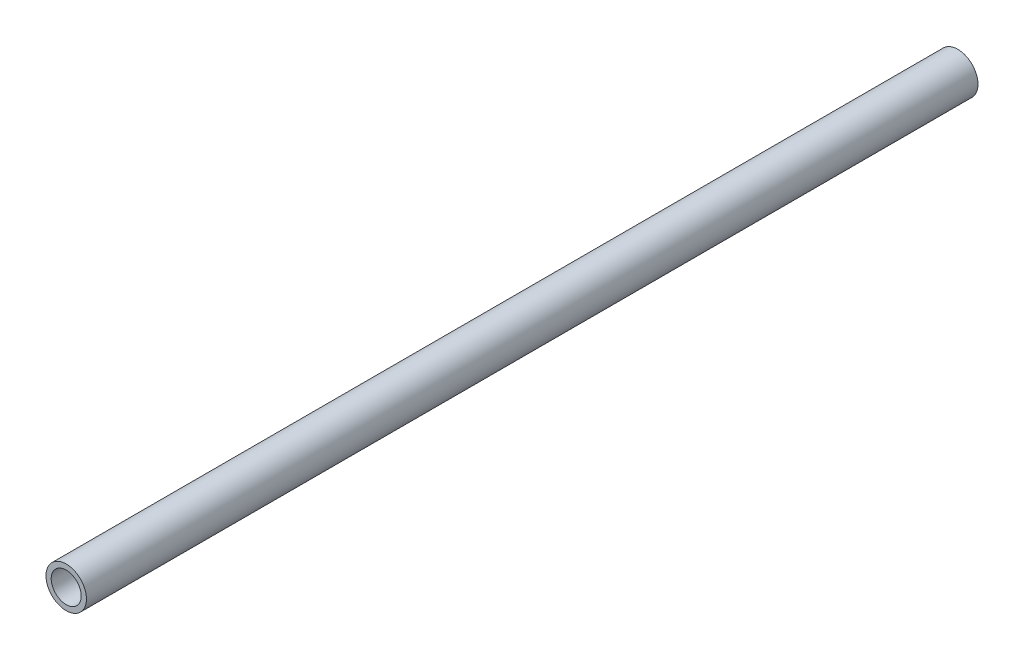
ISO-10303-21;
HEADER;
FILE_DESCRIPTION(('STEP AP214'),'2;1');
FILE_NAME('part.step','',(''),(''),'','','');
FILE_SCHEMA(('AUTOMOTIVE_DESIGN { 1 0 10303 214 1 1 1 1 }'));
ENDSEC;
DATA;
#1=APPLICATION_CONTEXT('core data for automotive mechanical design processes');
#2=APPLICATION_PROTOCOL_DEFINITION('international standard','automotive_design',2000,#1);
#3=PRODUCT_CONTEXT('',#1,'mechanical');
#4=PRODUCT('Part','Part','',(#3));
#5=PRODUCT_RELATED_PRODUCT_CATEGORY('part','',(#4));
#6=PRODUCT_DEFINITION_FORMATION('','',#4);
#7=PRODUCT_DEFINITION_CONTEXT('part definition',#1,'design');
#8=PRODUCT_DEFINITION('design','',#6,#7);
#9=PRODUCT_DEFINITION_SHAPE('','',#8);
#10=(LENGTH_UNIT() NAMED_UNIT(*) SI_UNIT(.MILLI.,.METRE.));
#11=(NAMED_UNIT(*) PLANE_ANGLE_UNIT() SI_UNIT($,.RADIAN.));
#12=(NAMED_UNIT(*) SI_UNIT($,.STERADIAN.) SOLID_ANGLE_UNIT());
#13=UNCERTAINTY_MEASURE_WITH_UNIT(LENGTH_MEASURE(1.E-05),#10,'distance_accuracy_value','');
#14=(GEOMETRIC_REPRESENTATION_CONTEXT(3) GLOBAL_UNCERTAINTY_ASSIGNED_CONTEXT((#13)) GLOBAL_UNIT_ASSIGNED_CONTEXT((#10,
#11,#12)) REPRESENTATION_CONTEXT('',''));
#15=CARTESIAN_POINT('',(0.,0.,0.));
#16=DIRECTION('',(0.,0.,1.));
#17=DIRECTION('',(1.,0.,0.));
#18=AXIS2_PLACEMENT_3D('',#15,#16,#17);
#19=CARTESIAN_POINT('',(0.,0.,235.));
#20=DIRECTION('',(0.,0.,1.));
#21=DIRECTION('',(1.,0.,0.));
#22=AXIS2_PLACEMENT_3D('',#19,#20,#21);
#23=PLANE('',#22);
#24=CARTESIAN_POINT('',(0.,0.,235.));
#25=DIRECTION('',(0.,0.,1.));
#26=DIRECTION('',(1.,0.,0.));
#27=AXIS2_PLACEMENT_3D('',#24,#25,#26);
#28=CIRCLE('',#27,10.668);
#29=CARTESIAN_POINT('',(10.668,0.,235.));
#30=VERTEX_POINT('',#29);
#31=EDGE_CURVE('E11',#30,#30,#28,.T.);
#32=ORIENTED_EDGE('',*,*,#31,.T.);
#33=EDGE_LOOP('',(#32));
#34=FACE_BOUND('',#33,.T.);
#35=CARTESIAN_POINT('',(0.,0.,235.));
#36=DIRECTION('',(0.,0.,1.));
#37=DIRECTION('',(1.,0.,0.));
#38=AXIS2_PLACEMENT_3D('',#35,#36,#37);
#39=CIRCLE('',#38,7.8994);
#40=CARTESIAN_POINT('',(7.8994,0.,235.));
#41=VERTEX_POINT('',#40);
#42=EDGE_CURVE('E50',#41,#41,#39,.T.);
#43=ORIENTED_EDGE('',*,*,#42,.F.);
#44=EDGE_LOOP('',(#43));
#45=FACE_BOUND('',#44,.T.);
#46=ADVANCED_FACE('F39',(#34,#45),#23,.T.);
#47=CARTESIAN_POINT('',(0.,0.,-235.));
#48=DIRECTION('',(0.,0.,1.));
#49=DIRECTION('',(1.,0.,0.));
#50=AXIS2_PLACEMENT_3D('',#47,#48,#49);
#51=PLANE('',#50);
#52=CARTESIAN_POINT('',(0.,0.,-235.));
#53=DIRECTION('',(0.,0.,1.));
#54=DIRECTION('',(1.,0.,0.));
#55=AXIS2_PLACEMENT_3D('',#52,#53,#54);
#56=CIRCLE('',#55,10.668);
#57=CARTESIAN_POINT('',(10.668,0.,-235.));
#58=VERTEX_POINT('',#57);
#59=EDGE_CURVE('E43',#58,#58,#56,.T.);
#60=ORIENTED_EDGE('',*,*,#59,.F.);
#61=EDGE_LOOP('',(#60));
#62=FACE_BOUND('',#61,.T.);
#63=CARTESIAN_POINT('',(0.,0.,-235.));
#64=DIRECTION('',(0.,0.,1.));
#65=DIRECTION('',(1.,0.,0.));
#66=AXIS2_PLACEMENT_3D('',#63,#64,#65);
#67=CIRCLE('',#66,7.8994);
#68=CARTESIAN_POINT('',(7.8994,0.,-235.));
#69=VERTEX_POINT('',#68);
#70=EDGE_CURVE('E52',#69,#69,#67,.T.);
#71=ORIENTED_EDGE('',*,*,#70,.T.);
#72=EDGE_LOOP('',(#71));
#73=FACE_BOUND('',#72,.T.);
#74=ADVANCED_FACE('F62',(#62,#73),#51,.F.);
#75=CARTESIAN_POINT('',(0.,0.,235.));
#76=DIRECTION('',(0.,0.,-1.));
#77=DIRECTION('',(-1.,0.,0.));
#78=AXIS2_PLACEMENT_3D('',#75,#76,#77);
#79=CYLINDRICAL_SURFACE('',#78,10.668);
#80=ORIENTED_EDGE('',*,*,#31,.F.);
#81=EDGE_LOOP('',(#80));
#82=FACE_BOUND('',#81,.T.);
#83=ORIENTED_EDGE('',*,*,#59,.T.);
#84=EDGE_LOOP('',(#83));
#85=FACE_BOUND('',#84,.T.);
#86=ADVANCED_FACE('F41',(#82,#85),#79,.T.);
#87=CARTESIAN_POINT('',(0.,0.,235.));
#88=DIRECTION('',(0.,0.,-1.));
#89=DIRECTION('',(-1.,0.,0.));
#90=AXIS2_PLACEMENT_3D('',#87,#88,#89);
#91=CYLINDRICAL_SURFACE('',#90,7.8994);
#92=ORIENTED_EDGE('',*,*,#42,.T.);
#93=EDGE_LOOP('',(#92));
#94=FACE_BOUND('',#93,.T.);
#95=ORIENTED_EDGE('',*,*,#70,.F.);
#96=EDGE_LOOP('',(#95));
#97=FACE_BOUND('',#96,.T.);
#98=ADVANCED_FACE('F58',(#94,#97),#91,.F.);
#99=CLOSED_SHELL('',(#46,#74,#86,#98));
#100=MANIFOLD_SOLID_BREP('B2',#99);
#101=ADVANCED_BREP_SHAPE_REPRESENTATION('',(#18,#100),#14);
#102=SHAPE_DEFINITION_REPRESENTATION(#9,#101);
ENDSEC;
END-ISO-10303-21;
